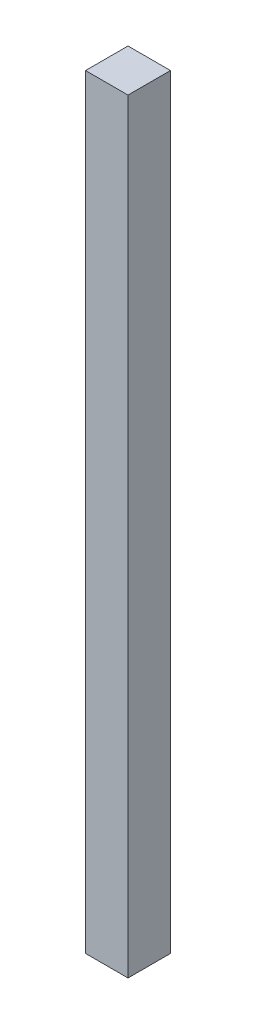
ISO-10303-21;
HEADER;
FILE_DESCRIPTION(('STEP AP214'),'2;1');
FILE_NAME('part.step','',(''),(''),'','','');
FILE_SCHEMA(('AUTOMOTIVE_DESIGN { 1 0 10303 214 1 1 1 1 }'));
ENDSEC;
DATA;
#1=APPLICATION_CONTEXT('core data for automotive mechanical design processes');
#2=APPLICATION_PROTOCOL_DEFINITION('international standard','automotive_design',2000,#1);
#3=PRODUCT_CONTEXT('',#1,'mechanical');
#4=PRODUCT('Part','Part','',(#3));
#5=PRODUCT_RELATED_PRODUCT_CATEGORY('part','',(#4));
#6=PRODUCT_DEFINITION_FORMATION('','',#4);
#7=PRODUCT_DEFINITION_CONTEXT('part definition',#1,'design');
#8=PRODUCT_DEFINITION('design','',#6,#7);
#9=PRODUCT_DEFINITION_SHAPE('','',#8);
#10=(LENGTH_UNIT() NAMED_UNIT(*) SI_UNIT(.MILLI.,.METRE.));
#11=(NAMED_UNIT(*) PLANE_ANGLE_UNIT() SI_UNIT($,.RADIAN.));
#12=(NAMED_UNIT(*) SI_UNIT($,.STERADIAN.) SOLID_ANGLE_UNIT());
#13=UNCERTAINTY_MEASURE_WITH_UNIT(LENGTH_MEASURE(1.E-05),#10,'distance_accuracy_value','');
#14=(GEOMETRIC_REPRESENTATION_CONTEXT(3) GLOBAL_UNCERTAINTY_ASSIGNED_CONTEXT((#13)) GLOBAL_UNIT_ASSIGNED_CONTEXT((#10,
#11,#12)) REPRESENTATION_CONTEXT('',''));
#15=CARTESIAN_POINT('',(0.,0.,0.));
#16=DIRECTION('',(0.,0.,1.));
#17=DIRECTION('',(1.,0.,0.));
#18=AXIS2_PLACEMENT_3D('',#15,#16,#17);
#19=CARTESIAN_POINT('',(7.7715611723761E-13,457.2,0.));
#20=DIRECTION('',(1.,0.,0.));
#21=DIRECTION('',(0.,0.,-1.));
#22=AXIS2_PLACEMENT_3D('',#19,#20,#21);
#23=PLANE('',#22);
#24=DIRECTION('',(0.,0.,1.));
#25=VECTOR('',#24,1.);
#26=CARTESIAN_POINT('',(0.,0.,0.));
#27=LINE('',#26,#25);
#28=CARTESIAN_POINT('',(0.,0.,-25.4000000000001));
#29=VERTEX_POINT('',#28);
#30=CARTESIAN_POINT('',(0.,0.,0.));
#31=VERTEX_POINT('',#30);
#32=EDGE_CURVE('E97',#29,#31,#27,.T.);
#33=ORIENTED_EDGE('',*,*,#32,.T.);
#34=DIRECTION('',(0.,-1.,0.));
#35=VECTOR('',#34,1.);
#36=CARTESIAN_POINT('',(7.7715611723761E-13,457.2,0.));
#37=LINE('',#36,#35);
#38=CARTESIAN_POINT('',(7.7715611723761E-13,457.2,0.));
#39=VERTEX_POINT('',#38);
#40=EDGE_CURVE('E11',#39,#31,#37,.T.);
#41=ORIENTED_EDGE('',*,*,#40,.F.);
#42=DIRECTION('',(0.,0.,1.));
#43=VECTOR('',#42,1.);
#44=CARTESIAN_POINT('',(7.7715611723761E-13,457.2,0.));
#45=LINE('',#44,#43);
#46=CARTESIAN_POINT('',(7.7715611723761E-13,457.2,-25.4000000000001));
#47=VERTEX_POINT('',#46);
#48=EDGE_CURVE('E85',#47,#39,#45,.T.);
#49=ORIENTED_EDGE('',*,*,#48,.F.);
#50=DIRECTION('',(0.,-1.,0.));
#51=VECTOR('',#50,1.);
#52=CARTESIAN_POINT('',(7.7715611723761E-13,457.2,-25.4000000000001));
#53=LINE('',#52,#51);
#54=EDGE_CURVE('E93',#47,#29,#53,.T.);
#55=ORIENTED_EDGE('',*,*,#54,.T.);
#56=EDGE_LOOP('',(#33,#41,#49,#55));
#57=FACE_BOUND('',#56,.T.);
#58=ADVANCED_FACE('F34',(#57),#23,.F.);
#59=CARTESIAN_POINT('',(7.7715611723761E-13,457.2,0.));
#60=DIRECTION('',(0.,0.,-1.));
#61=DIRECTION('',(-1.,0.,0.));
#62=AXIS2_PLACEMENT_3D('',#59,#60,#61);
#63=PLANE('',#62);
#64=DIRECTION('',(1.,0.,0.));
#65=VECTOR('',#64,1.);
#66=CARTESIAN_POINT('',(0.,0.,0.));
#67=LINE('',#66,#65);
#68=CARTESIAN_POINT('',(25.4000000000011,4.44089209850063E-13,0.));
#69=VERTEX_POINT('',#68);
#70=EDGE_CURVE('E89',#31,#69,#67,.T.);
#71=ORIENTED_EDGE('',*,*,#70,.T.);
#72=DIRECTION('',(0.,-1.,0.));
#73=VECTOR('',#72,1.);
#74=CARTESIAN_POINT('',(25.4000000000009,457.200000000001,0.));
#75=LINE('',#74,#73);
#76=CARTESIAN_POINT('',(25.4000000000009,457.200000000001,0.));
#77=VERTEX_POINT('',#76);
#78=EDGE_CURVE('E42',#77,#69,#75,.T.);
#79=ORIENTED_EDGE('',*,*,#78,.F.);
#80=DIRECTION('',(1.,0.,0.));
#81=VECTOR('',#80,1.);
#82=CARTESIAN_POINT('',(7.7715611723761E-13,457.2,0.));
#83=LINE('',#82,#81);
#84=EDGE_CURVE('E80',#39,#77,#83,.T.);
#85=ORIENTED_EDGE('',*,*,#84,.F.);
#86=ORIENTED_EDGE('',*,*,#40,.T.);
#87=EDGE_LOOP('',(#71,#79,#85,#86));
#88=FACE_BOUND('',#87,.T.);
#89=ADVANCED_FACE('F88',(#88),#63,.F.);
#90=CARTESIAN_POINT('',(25.4000000000009,457.200000000001,0.));
#91=DIRECTION('',(-1.,0.,0.));
#92=DIRECTION('',(0.,0.,1.));
#93=AXIS2_PLACEMENT_3D('',#90,#91,#92);
#94=PLANE('',#93);
#95=DIRECTION('',(0.,0.,-1.));
#96=VECTOR('',#95,1.);
#97=CARTESIAN_POINT('',(25.4000000000011,4.44089209850063E-13,0.));
#98=LINE('',#97,#96);
#99=CARTESIAN_POINT('',(25.4000000000011,4.44089209850063E-13,-25.4000000000001));
#100=VERTEX_POINT('',#99);
#101=EDGE_CURVE('E67',#69,#100,#98,.T.);
#102=ORIENTED_EDGE('',*,*,#101,.T.);
#103=DIRECTION('',(0.,-1.,0.));
#104=VECTOR('',#103,1.);
#105=CARTESIAN_POINT('',(25.4000000000009,457.200000000001,-25.4000000000001));
#106=LINE('',#105,#104);
#107=CARTESIAN_POINT('',(25.4000000000009,457.200000000001,-25.4000000000001));
#108=VERTEX_POINT('',#107);
#109=EDGE_CURVE('E90',#108,#100,#106,.T.);
#110=ORIENTED_EDGE('',*,*,#109,.F.);
#111=DIRECTION('',(0.,0.,-1.));
#112=VECTOR('',#111,1.);
#113=CARTESIAN_POINT('',(25.4000000000009,457.200000000001,0.));
#114=LINE('',#113,#112);
#115=EDGE_CURVE('E83',#77,#108,#114,.T.);
#116=ORIENTED_EDGE('',*,*,#115,.F.);
#117=ORIENTED_EDGE('',*,*,#78,.T.);
#118=EDGE_LOOP('',(#102,#110,#116,#117));
#119=FACE_BOUND('',#118,.T.);
#120=ADVANCED_FACE('F91',(#119),#94,.F.);
#121=CARTESIAN_POINT('',(7.7715611723761E-13,457.2,-25.4000000000001));
#122=DIRECTION('',(0.,0.,1.));
#123=DIRECTION('',(1.,0.,0.));
#124=AXIS2_PLACEMENT_3D('',#121,#122,#123);
#125=PLANE('',#124);
#126=DIRECTION('',(-1.,0.,0.));
#127=VECTOR('',#126,1.);
#128=CARTESIAN_POINT('',(0.,0.,-25.4000000000001));
#129=LINE('',#128,#127);
#130=EDGE_CURVE('E73',#100,#29,#129,.T.);
#131=ORIENTED_EDGE('',*,*,#130,.T.);
#132=ORIENTED_EDGE('',*,*,#54,.F.);
#133=DIRECTION('',(-1.,0.,0.));
#134=VECTOR('',#133,1.);
#135=CARTESIAN_POINT('',(7.7715611723761E-13,457.2,-25.4000000000001));
#136=LINE('',#135,#134);
#137=EDGE_CURVE('E50',#108,#47,#136,.T.);
#138=ORIENTED_EDGE('',*,*,#137,.F.);
#139=ORIENTED_EDGE('',*,*,#109,.T.);
#140=EDGE_LOOP('',(#131,#132,#138,#139));
#141=FACE_BOUND('',#140,.T.);
#142=ADVANCED_FACE('F104',(#141),#125,.F.);
#143=CARTESIAN_POINT('',(7.7715611723761E-13,457.2,0.));
#144=DIRECTION('',(0.,-1.,0.));
#145=DIRECTION('',(0.,0.,-1.));
#146=AXIS2_PLACEMENT_3D('',#143,#144,#145);
#147=PLANE('',#146);
#148=ORIENTED_EDGE('',*,*,#48,.T.);
#149=ORIENTED_EDGE('',*,*,#84,.T.);
#150=ORIENTED_EDGE('',*,*,#115,.T.);
#151=ORIENTED_EDGE('',*,*,#137,.T.);
#152=EDGE_LOOP('',(#148,#149,#150,#151));
#153=FACE_BOUND('',#152,.T.);
#154=ADVANCED_FACE('F81',(#153),#147,.F.);
#155=CARTESIAN_POINT('',(0.,0.,0.));
#156=DIRECTION('',(0.,-1.,0.));
#157=DIRECTION('',(0.,0.,-1.));
#158=AXIS2_PLACEMENT_3D('',#155,#156,#157);
#159=PLANE('',#158);
#160=ORIENTED_EDGE('',*,*,#32,.F.);
#161=ORIENTED_EDGE('',*,*,#130,.F.);
#162=ORIENTED_EDGE('',*,*,#101,.F.);
#163=ORIENTED_EDGE('',*,*,#70,.F.);
#164=EDGE_LOOP('',(#160,#161,#162,#163));
#165=FACE_BOUND('',#164,.T.);
#166=ADVANCED_FACE('F107',(#165),#159,.T.);
#167=CLOSED_SHELL('',(#58,#89,#120,#142,#154,#166));
#168=MANIFOLD_SOLID_BREP('B2',#167);
#169=ADVANCED_BREP_SHAPE_REPRESENTATION('',(#18,#168),#14);
#170=SHAPE_DEFINITION_REPRESENTATION(#9,#169);
ENDSEC;
END-ISO-10303-21;
